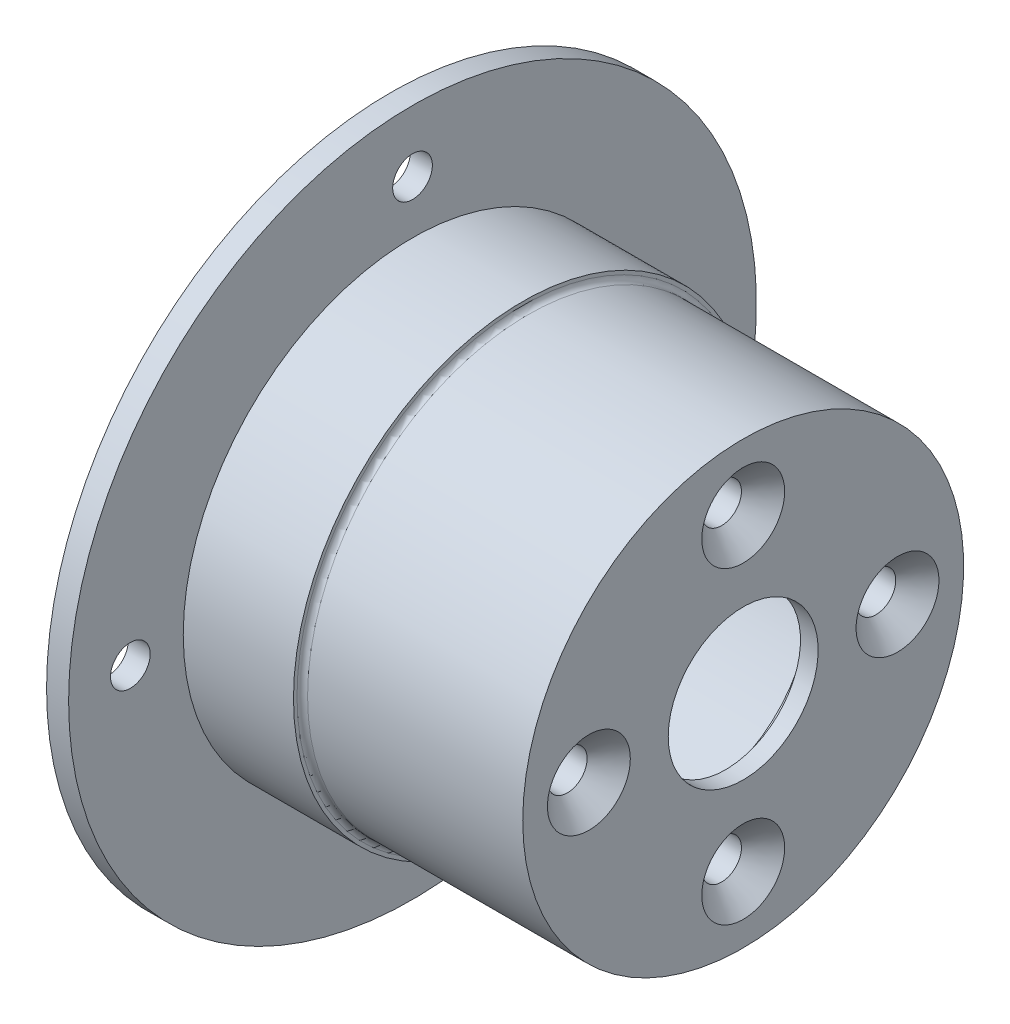
ISO-10303-21;
HEADER;
FILE_DESCRIPTION(('STEP AP214'),'2;1');
FILE_NAME('part.step','',(''),(''),'','','');
FILE_SCHEMA(('AUTOMOTIVE_DESIGN { 1 0 10303 214 1 1 1 1 }'));
ENDSEC;
DATA;
#1=APPLICATION_CONTEXT('core data for automotive mechanical design processes');
#2=APPLICATION_PROTOCOL_DEFINITION('international standard','automotive_design',2000,#1);
#3=PRODUCT_CONTEXT('',#1,'mechanical');
#4=PRODUCT('Part','Part','',(#3));
#5=PRODUCT_RELATED_PRODUCT_CATEGORY('part','',(#4));
#6=PRODUCT_DEFINITION_FORMATION('','',#4);
#7=PRODUCT_DEFINITION_CONTEXT('part definition',#1,'design');
#8=PRODUCT_DEFINITION('design','',#6,#7);
#9=PRODUCT_DEFINITION_SHAPE('','',#8);
#10=(LENGTH_UNIT() NAMED_UNIT(*) SI_UNIT(.MILLI.,.METRE.));
#11=(NAMED_UNIT(*) PLANE_ANGLE_UNIT() SI_UNIT($,.RADIAN.));
#12=(NAMED_UNIT(*) SI_UNIT($,.STERADIAN.) SOLID_ANGLE_UNIT());
#13=UNCERTAINTY_MEASURE_WITH_UNIT(LENGTH_MEASURE(1.E-05),#10,'distance_accuracy_value','');
#14=(GEOMETRIC_REPRESENTATION_CONTEXT(3) GLOBAL_UNCERTAINTY_ASSIGNED_CONTEXT((#13)) GLOBAL_UNIT_ASSIGNED_CONTEXT((#10,
#11,#12)) REPRESENTATION_CONTEXT('',''));
#15=CARTESIAN_POINT('',(0.,0.,0.));
#16=DIRECTION('',(0.,0.,1.));
#17=DIRECTION('',(1.,0.,0.));
#18=AXIS2_PLACEMENT_3D('',#15,#16,#17);
#19=CARTESIAN_POINT('',(0.,39.,0.));
#20=DIRECTION('',(1.,0.,0.));
#21=DIRECTION('',(0.,0.,-1.));
#22=AXIS2_PLACEMENT_3D('',#19,#20,#21);
#23=PLANE('',#22);
#24=CARTESIAN_POINT('',(0.,-32.,0.));
#25=DIRECTION('',(-1.,0.,0.));
#26=DIRECTION('',(0.,0.,1.));
#27=AXIS2_PLACEMENT_3D('',#24,#25,#26);
#28=CIRCLE('',#27,2.25);
#29=CARTESIAN_POINT('',(0.,-32.,2.25));
#30=VERTEX_POINT('',#29);
#31=EDGE_CURVE('E153',#30,#30,#28,.T.);
#32=ORIENTED_EDGE('',*,*,#31,.F.);
#33=EDGE_LOOP('',(#32));
#34=FACE_BOUND('',#33,.T.);
#35=CARTESIAN_POINT('',(0.,0.,-32.));
#36=DIRECTION('',(-1.,0.,0.));
#37=DIRECTION('',(0.,0.,1.));
#38=AXIS2_PLACEMENT_3D('',#35,#36,#37);
#39=CIRCLE('',#38,2.25);
#40=CARTESIAN_POINT('',(0.,0.,-29.75));
#41=VERTEX_POINT('',#40);
#42=EDGE_CURVE('E141',#41,#41,#39,.T.);
#43=ORIENTED_EDGE('',*,*,#42,.F.);
#44=EDGE_LOOP('',(#43));
#45=FACE_BOUND('',#44,.T.);
#46=CARTESIAN_POINT('',(0.,0.,0.));
#47=DIRECTION('',(-1.,0.,0.));
#48=DIRECTION('',(0.,0.,1.));
#49=AXIS2_PLACEMENT_3D('',#46,#47,#48);
#50=CIRCLE('',#49,21.);
#51=CARTESIAN_POINT('',(0.,0.,21.));
#52=VERTEX_POINT('',#51);
#53=EDGE_CURVE('E50',#52,#52,#50,.T.);
#54=ORIENTED_EDGE('',*,*,#53,.F.);
#55=EDGE_LOOP('',(#54));
#56=FACE_BOUND('',#55,.T.);
#57=CARTESIAN_POINT('',(0.,0.,0.));
#58=DIRECTION('',(-1.,0.,0.));
#59=DIRECTION('',(0.,0.,1.));
#60=AXIS2_PLACEMENT_3D('',#57,#58,#59);
#61=CIRCLE('',#60,39.);
#62=CARTESIAN_POINT('',(0.,0.,39.));
#63=VERTEX_POINT('',#62);
#64=EDGE_CURVE('E93',#63,#63,#61,.T.);
#65=ORIENTED_EDGE('',*,*,#64,.T.);
#66=EDGE_LOOP('',(#65));
#67=FACE_BOUND('',#66,.T.);
#68=CARTESIAN_POINT('',(0.,0.,32.));
#69=DIRECTION('',(-1.,0.,0.));
#70=DIRECTION('',(0.,0.,1.));
#71=AXIS2_PLACEMENT_3D('',#68,#69,#70);
#72=CIRCLE('',#71,2.25);
#73=CARTESIAN_POINT('',(0.,0.,34.25));
#74=VERTEX_POINT('',#73);
#75=EDGE_CURVE('E147',#74,#74,#72,.T.);
#76=ORIENTED_EDGE('',*,*,#75,.F.);
#77=EDGE_LOOP('',(#76));
#78=FACE_BOUND('',#77,.T.);
#79=CARTESIAN_POINT('',(0.,32.,0.));
#80=DIRECTION('',(-1.,0.,0.));
#81=DIRECTION('',(0.,0.,1.));
#82=AXIS2_PLACEMENT_3D('',#79,#80,#81);
#83=CIRCLE('',#82,2.25);
#84=CARTESIAN_POINT('',(0.,32.,2.25));
#85=VERTEX_POINT('',#84);
#86=EDGE_CURVE('E160',#85,#85,#83,.T.);
#87=ORIENTED_EDGE('',*,*,#86,.F.);
#88=EDGE_LOOP('',(#87));
#89=FACE_BOUND('',#88,.T.);
#90=ADVANCED_FACE('F36',(#34,#45,#56,#67,#78,#89),#23,.F.);
#91=CARTESIAN_POINT('',(-64.1033524540557,0.,0.));
#92=DIRECTION('',(-1.,0.,0.));
#93=DIRECTION('',(0.,0.,1.));
#94=AXIS2_PLACEMENT_3D('',#91,#92,#93);
#95=CYLINDRICAL_SURFACE('',#94,21.);
#96=CARTESIAN_POINT('',(35.,0.,0.));
#97=DIRECTION('',(-1.,0.,0.));
#98=DIRECTION('',(0.,0.,1.));
#99=AXIS2_PLACEMENT_3D('',#96,#97,#98);
#100=CIRCLE('',#99,21.);
#101=CARTESIAN_POINT('',(35.,0.,21.));
#102=VERTEX_POINT('',#101);
#103=EDGE_CURVE('E56',#102,#102,#100,.T.);
#104=ORIENTED_EDGE('',*,*,#103,.F.);
#105=EDGE_LOOP('',(#104));
#106=FACE_BOUND('',#105,.T.);
#107=ORIENTED_EDGE('',*,*,#53,.T.);
#108=EDGE_LOOP('',(#107));
#109=FACE_BOUND('',#108,.T.);
#110=ADVANCED_FACE('F167',(#106,#109),#95,.F.);
#111=CARTESIAN_POINT('',(35.,21.,0.));
#112=DIRECTION('',(1.,0.,0.));
#113=DIRECTION('',(0.,0.,-1.));
#114=AXIS2_PLACEMENT_3D('',#111,#112,#113);
#115=PLANE('',#114);
#116=CARTESIAN_POINT('',(35.,17.5,0.));
#117=DIRECTION('',(1.,0.,0.));
#118=DIRECTION('',(0.,0.,-1.));
#119=AXIS2_PLACEMENT_3D('',#116,#117,#118);
#120=CIRCLE('',#119,2.24999999999999);
#121=CARTESIAN_POINT('',(35.,17.5,-2.24999999999999));
#122=VERTEX_POINT('',#121);
#123=EDGE_CURVE('E129',#122,#122,#120,.T.);
#124=ORIENTED_EDGE('',*,*,#123,.T.);
#125=EDGE_LOOP('',(#124));
#126=FACE_BOUND('',#125,.T.);
#127=CARTESIAN_POINT('',(35.,0.,-17.5));
#128=DIRECTION('',(1.,0.,0.));
#129=DIRECTION('',(0.,0.,-1.));
#130=AXIS2_PLACEMENT_3D('',#127,#128,#129);
#131=CIRCLE('',#130,2.24999999999999);
#132=CARTESIAN_POINT('',(35.,0.,-19.75));
#133=VERTEX_POINT('',#132);
#134=EDGE_CURVE('E118',#133,#133,#131,.T.);
#135=ORIENTED_EDGE('',*,*,#134,.T.);
#136=EDGE_LOOP('',(#135));
#137=FACE_BOUND('',#136,.T.);
#138=CARTESIAN_POINT('',(35.,-17.5,0.));
#139=DIRECTION('',(1.,0.,0.));
#140=DIRECTION('',(0.,0.,-1.));
#141=AXIS2_PLACEMENT_3D('',#138,#139,#140);
#142=CIRCLE('',#141,2.24999999999999);
#143=CARTESIAN_POINT('',(35.,-17.5,-2.24999999999999));
#144=VERTEX_POINT('',#143);
#145=EDGE_CURVE('E106',#144,#144,#142,.T.);
#146=ORIENTED_EDGE('',*,*,#145,.T.);
#147=EDGE_LOOP('',(#146));
#148=FACE_BOUND('',#147,.T.);
#149=CARTESIAN_POINT('',(35.,0.,17.5));
#150=DIRECTION('',(1.,0.,0.));
#151=DIRECTION('',(0.,0.,-1.));
#152=AXIS2_PLACEMENT_3D('',#149,#150,#151);
#153=CIRCLE('',#152,2.24999999999999);
#154=CARTESIAN_POINT('',(35.,0.,15.25));
#155=VERTEX_POINT('',#154);
#156=EDGE_CURVE('E97',#155,#155,#153,.T.);
#157=ORIENTED_EDGE('',*,*,#156,.T.);
#158=EDGE_LOOP('',(#157));
#159=FACE_BOUND('',#158,.T.);
#160=CARTESIAN_POINT('',(35.,0.,0.));
#161=DIRECTION('',(-1.,0.,0.));
#162=DIRECTION('',(0.,0.,1.));
#163=AXIS2_PLACEMENT_3D('',#160,#161,#162);
#164=CIRCLE('',#163,12.5);
#165=CARTESIAN_POINT('',(35.,0.,12.5));
#166=VERTEX_POINT('',#165);
#167=EDGE_CURVE('E62',#166,#166,#164,.T.);
#168=ORIENTED_EDGE('',*,*,#167,.F.);
#169=EDGE_LOOP('',(#168));
#170=FACE_BOUND('',#169,.T.);
#171=ORIENTED_EDGE('',*,*,#103,.T.);
#172=EDGE_LOOP('',(#171));
#173=FACE_BOUND('',#172,.T.);
#174=ADVANCED_FACE('F173',(#126,#137,#148,#159,#170,#173),#115,.F.);
#175=CARTESIAN_POINT('',(-64.1033524540557,0.,0.));
#176=DIRECTION('',(-1.,0.,0.));
#177=DIRECTION('',(0.,0.,1.));
#178=AXIS2_PLACEMENT_3D('',#175,#176,#177);
#179=CYLINDRICAL_SURFACE('',#178,12.5);
#180=CARTESIAN_POINT('',(38.,0.,0.));
#181=DIRECTION('',(-1.,0.,0.));
#182=DIRECTION('',(0.,0.,1.));
#183=AXIS2_PLACEMENT_3D('',#180,#181,#182);
#184=CIRCLE('',#183,12.5);
#185=CARTESIAN_POINT('',(38.,0.,12.5));
#186=VERTEX_POINT('',#185);
#187=EDGE_CURVE('E66',#186,#186,#184,.T.);
#188=ORIENTED_EDGE('',*,*,#187,.F.);
#189=EDGE_LOOP('',(#188));
#190=FACE_BOUND('',#189,.T.);
#191=ORIENTED_EDGE('',*,*,#167,.T.);
#192=EDGE_LOOP('',(#191));
#193=FACE_BOUND('',#192,.T.);
#194=ADVANCED_FACE('F210',(#190,#193),#179,.F.);
#195=CARTESIAN_POINT('',(38.,12.5,0.));
#196=DIRECTION('',(1.,0.,0.));
#197=DIRECTION('',(0.,0.,-1.));
#198=AXIS2_PLACEMENT_3D('',#195,#196,#197);
#199=PLANE('',#198);
#200=CARTESIAN_POINT('',(38.,0.,0.));
#201=DIRECTION('',(-1.,0.,0.));
#202=DIRECTION('',(0.,0.,1.));
#203=AXIS2_PLACEMENT_3D('',#200,#201,#202);
#204=CIRCLE('',#203,8.5);
#205=CARTESIAN_POINT('',(38.,0.,8.5));
#206=VERTEX_POINT('',#205);
#207=EDGE_CURVE('E70',#206,#206,#204,.T.);
#208=ORIENTED_EDGE('',*,*,#207,.F.);
#209=EDGE_LOOP('',(#208));
#210=FACE_BOUND('',#209,.T.);
#211=ORIENTED_EDGE('',*,*,#187,.T.);
#212=EDGE_LOOP('',(#211));
#213=FACE_BOUND('',#212,.T.);
#214=ADVANCED_FACE('F206',(#210,#213),#199,.F.);
#215=CARTESIAN_POINT('',(-64.1033524540557,0.,0.));
#216=DIRECTION('',(-1.,0.,0.));
#217=DIRECTION('',(0.,0.,1.));
#218=AXIS2_PLACEMENT_3D('',#215,#216,#217);
#219=CYLINDRICAL_SURFACE('',#218,8.5);
#220=CARTESIAN_POINT('',(40.,0.,0.));
#221=DIRECTION('',(-1.,0.,0.));
#222=DIRECTION('',(0.,0.,1.));
#223=AXIS2_PLACEMENT_3D('',#220,#221,#222);
#224=CIRCLE('',#223,8.5);
#225=CARTESIAN_POINT('',(40.,0.,8.5));
#226=VERTEX_POINT('',#225);
#227=EDGE_CURVE('E74',#226,#226,#224,.T.);
#228=ORIENTED_EDGE('',*,*,#227,.F.);
#229=EDGE_LOOP('',(#228));
#230=FACE_BOUND('',#229,.T.);
#231=ORIENTED_EDGE('',*,*,#207,.T.);
#232=EDGE_LOOP('',(#231));
#233=FACE_BOUND('',#232,.T.);
#234=ADVANCED_FACE('F202',(#230,#233),#219,.F.);
#235=CARTESIAN_POINT('',(40.,8.5,0.));
#236=DIRECTION('',(-1.,0.,0.));
#237=DIRECTION('',(0.,0.,1.));
#238=AXIS2_PLACEMENT_3D('',#235,#236,#237);
#239=PLANE('',#238);
#240=CARTESIAN_POINT('',(40.,17.5,0.));
#241=DIRECTION('',(1.,0.,0.));
#242=DIRECTION('',(0.,0.,-1.));
#243=AXIS2_PLACEMENT_3D('',#240,#241,#242);
#244=CIRCLE('',#243,4.7);
#245=CARTESIAN_POINT('',(40.,17.5,-4.7));
#246=VERTEX_POINT('',#245);
#247=EDGE_CURVE('E135',#246,#246,#244,.T.);
#248=ORIENTED_EDGE('',*,*,#247,.F.);
#249=EDGE_LOOP('',(#248));
#250=FACE_BOUND('',#249,.T.);
#251=CARTESIAN_POINT('',(40.,0.,-17.5));
#252=DIRECTION('',(1.,0.,0.));
#253=DIRECTION('',(0.,0.,-1.));
#254=AXIS2_PLACEMENT_3D('',#251,#252,#253);
#255=CIRCLE('',#254,4.7);
#256=CARTESIAN_POINT('',(40.,0.,-22.2));
#257=VERTEX_POINT('',#256);
#258=EDGE_CURVE('E125',#257,#257,#255,.T.);
#259=ORIENTED_EDGE('',*,*,#258,.F.);
#260=EDGE_LOOP('',(#259));
#261=FACE_BOUND('',#260,.T.);
#262=CARTESIAN_POINT('',(40.,-17.5,0.));
#263=DIRECTION('',(1.,0.,0.));
#264=DIRECTION('',(0.,0.,-1.));
#265=AXIS2_PLACEMENT_3D('',#262,#263,#264);
#266=CIRCLE('',#265,4.7);
#267=CARTESIAN_POINT('',(40.,-17.5,-4.7));
#268=VERTEX_POINT('',#267);
#269=EDGE_CURVE('E114',#268,#268,#266,.T.);
#270=ORIENTED_EDGE('',*,*,#269,.F.);
#271=EDGE_LOOP('',(#270));
#272=FACE_BOUND('',#271,.T.);
#273=CARTESIAN_POINT('',(40.,0.,17.5));
#274=DIRECTION('',(1.,0.,0.));
#275=DIRECTION('',(0.,0.,-1.));
#276=AXIS2_PLACEMENT_3D('',#273,#274,#275);
#277=CIRCLE('',#276,4.7);
#278=CARTESIAN_POINT('',(40.,0.,12.8));
#279=VERTEX_POINT('',#278);
#280=EDGE_CURVE('E103',#279,#279,#277,.T.);
#281=ORIENTED_EDGE('',*,*,#280,.F.);
#282=EDGE_LOOP('',(#281));
#283=FACE_BOUND('',#282,.T.);
#284=CARTESIAN_POINT('',(40.,0.,0.));
#285=DIRECTION('',(-1.,0.,0.));
#286=DIRECTION('',(0.,0.,1.));
#287=AXIS2_PLACEMENT_3D('',#284,#285,#286);
#288=CIRCLE('',#287,25.);
#289=CARTESIAN_POINT('',(40.,0.,25.));
#290=VERTEX_POINT('',#289);
#291=EDGE_CURVE('E78',#290,#290,#288,.T.);
#292=ORIENTED_EDGE('',*,*,#291,.F.);
#293=EDGE_LOOP('',(#292));
#294=FACE_BOUND('',#293,.T.);
#295=ORIENTED_EDGE('',*,*,#227,.T.);
#296=EDGE_LOOP('',(#295));
#297=FACE_BOUND('',#296,.T.);
#298=ADVANCED_FACE('F199',(#250,#261,#272,#283,#294,#297),#239,.F.);
#299=CARTESIAN_POINT('',(-64.1033524540557,0.,0.));
#300=DIRECTION('',(-1.,0.,0.));
#301=DIRECTION('',(0.,0.,1.));
#302=AXIS2_PLACEMENT_3D('',#299,#300,#301);
#303=CYLINDRICAL_SURFACE('',#302,25.);
#304=CARTESIAN_POINT('',(15.6,0.,0.));
#305=DIRECTION('',(-1.,0.,0.));
#306=DIRECTION('',(0.,0.,1.));
#307=AXIS2_PLACEMENT_3D('',#304,#305,#306);
#308=CIRCLE('',#307,25.);
#309=CARTESIAN_POINT('',(15.6,0.,25.));
#310=VERTEX_POINT('',#309);
#311=EDGE_CURVE('E10',#310,#310,#308,.F.);
#312=ORIENTED_EDGE('',*,*,#311,.T.);
#313=EDGE_LOOP('',(#312));
#314=FACE_BOUND('',#313,.T.);
#315=ORIENTED_EDGE('',*,*,#291,.T.);
#316=EDGE_LOOP('',(#315));
#317=FACE_BOUND('',#316,.T.);
#318=ADVANCED_FACE('F196',(#314,#317),#303,.T.);
#319=CARTESIAN_POINT('',(15.,25.,0.));
#320=DIRECTION('',(-1.,0.,0.));
#321=DIRECTION('',(0.,0.,1.));
#322=AXIS2_PLACEMENT_3D('',#319,#320,#321);
#323=PLANE('',#322);
#324=CARTESIAN_POINT('',(15.,0.,0.));
#325=DIRECTION('',(-1.,0.,0.));
#326=DIRECTION('',(0.,0.,1.));
#327=AXIS2_PLACEMENT_3D('',#324,#325,#326);
#328=CIRCLE('',#327,25.6);
#329=CARTESIAN_POINT('',(15.,0.,25.6));
#330=VERTEX_POINT('',#329);
#331=EDGE_CURVE('E44',#330,#330,#328,.T.);
#332=ORIENTED_EDGE('',*,*,#331,.T.);
#333=EDGE_LOOP('',(#332));
#334=FACE_BOUND('',#333,.T.);
#335=CARTESIAN_POINT('',(15.,0.,0.));
#336=DIRECTION('',(-1.,0.,0.));
#337=DIRECTION('',(0.,0.,1.));
#338=AXIS2_PLACEMENT_3D('',#335,#336,#337);
#339=CIRCLE('',#338,26.);
#340=CARTESIAN_POINT('',(15.,0.,26.));
#341=VERTEX_POINT('',#340);
#342=EDGE_CURVE('E82',#341,#341,#339,.T.);
#343=ORIENTED_EDGE('',*,*,#342,.F.);
#344=EDGE_LOOP('',(#343));
#345=FACE_BOUND('',#344,.T.);
#346=ADVANCED_FACE('F192',(#334,#345),#323,.F.);
#347=CARTESIAN_POINT('',(-64.1033524540557,0.,0.));
#348=DIRECTION('',(-1.,0.,0.));
#349=DIRECTION('',(0.,0.,1.));
#350=AXIS2_PLACEMENT_3D('',#347,#348,#349);
#351=CYLINDRICAL_SURFACE('',#350,26.);
#352=CARTESIAN_POINT('',(2.5,0.,0.));
#353=DIRECTION('',(-1.,0.,0.));
#354=DIRECTION('',(0.,0.,1.));
#355=AXIS2_PLACEMENT_3D('',#352,#353,#354);
#356=CIRCLE('',#355,26.);
#357=CARTESIAN_POINT('',(2.5,0.,26.));
#358=VERTEX_POINT('',#357);
#359=EDGE_CURVE('E85',#358,#358,#356,.T.);
#360=ORIENTED_EDGE('',*,*,#359,.F.);
#361=EDGE_LOOP('',(#360));
#362=FACE_BOUND('',#361,.T.);
#363=ORIENTED_EDGE('',*,*,#342,.T.);
#364=EDGE_LOOP('',(#363));
#365=FACE_BOUND('',#364,.T.);
#366=ADVANCED_FACE('F188',(#362,#365),#351,.T.);
#367=CARTESIAN_POINT('',(2.5,26.,0.));
#368=DIRECTION('',(-1.,0.,0.));
#369=DIRECTION('',(0.,0.,1.));
#370=AXIS2_PLACEMENT_3D('',#367,#368,#369);
#371=PLANE('',#370);
#372=CARTESIAN_POINT('',(2.5,32.,0.));
#373=DIRECTION('',(-1.,0.,0.));
#374=DIRECTION('',(0.,0.,1.));
#375=AXIS2_PLACEMENT_3D('',#372,#373,#374);
#376=CIRCLE('',#375,2.25);
#377=CARTESIAN_POINT('',(2.5,32.,2.25));
#378=VERTEX_POINT('',#377);
#379=EDGE_CURVE('E156',#378,#378,#376,.T.);
#380=ORIENTED_EDGE('',*,*,#379,.T.);
#381=EDGE_LOOP('',(#380));
#382=FACE_BOUND('',#381,.T.);
#383=CARTESIAN_POINT('',(2.5,-32.,0.));
#384=DIRECTION('',(-1.,0.,0.));
#385=DIRECTION('',(0.,0.,1.));
#386=AXIS2_PLACEMENT_3D('',#383,#384,#385);
#387=CIRCLE('',#386,2.25);
#388=CARTESIAN_POINT('',(2.5,-32.,2.25));
#389=VERTEX_POINT('',#388);
#390=EDGE_CURVE('E150',#389,#389,#387,.T.);
#391=ORIENTED_EDGE('',*,*,#390,.T.);
#392=EDGE_LOOP('',(#391));
#393=FACE_BOUND('',#392,.T.);
#394=CARTESIAN_POINT('',(2.5,0.,32.));
#395=DIRECTION('',(-1.,0.,0.));
#396=DIRECTION('',(0.,0.,1.));
#397=AXIS2_PLACEMENT_3D('',#394,#395,#396);
#398=CIRCLE('',#397,2.25);
#399=CARTESIAN_POINT('',(2.5,0.,34.25));
#400=VERTEX_POINT('',#399);
#401=EDGE_CURVE('E144',#400,#400,#398,.T.);
#402=ORIENTED_EDGE('',*,*,#401,.T.);
#403=EDGE_LOOP('',(#402));
#404=FACE_BOUND('',#403,.T.);
#405=CARTESIAN_POINT('',(2.5,0.,-32.));
#406=DIRECTION('',(-1.,0.,0.));
#407=DIRECTION('',(0.,0.,1.));
#408=AXIS2_PLACEMENT_3D('',#405,#406,#407);
#409=CIRCLE('',#408,2.25);
#410=CARTESIAN_POINT('',(2.5,0.,-29.75));
#411=VERTEX_POINT('',#410);
#412=EDGE_CURVE('E138',#411,#411,#409,.T.);
#413=ORIENTED_EDGE('',*,*,#412,.T.);
#414=EDGE_LOOP('',(#413));
#415=FACE_BOUND('',#414,.T.);
#416=CARTESIAN_POINT('',(2.5,0.,0.));
#417=DIRECTION('',(-1.,0.,0.));
#418=DIRECTION('',(0.,0.,1.));
#419=AXIS2_PLACEMENT_3D('',#416,#417,#418);
#420=CIRCLE('',#419,39.);
#421=CARTESIAN_POINT('',(2.5,0.,39.));
#422=VERTEX_POINT('',#421);
#423=EDGE_CURVE('E89',#422,#422,#420,.T.);
#424=ORIENTED_EDGE('',*,*,#423,.F.);
#425=EDGE_LOOP('',(#424));
#426=FACE_BOUND('',#425,.T.);
#427=ORIENTED_EDGE('',*,*,#359,.T.);
#428=EDGE_LOOP('',(#427));
#429=FACE_BOUND('',#428,.T.);
#430=ADVANCED_FACE('F184',(#382,#393,#404,#415,#426,#429),#371,.F.);
#431=CARTESIAN_POINT('',(-64.1033524540557,0.,0.));
#432=DIRECTION('',(-1.,0.,0.));
#433=DIRECTION('',(0.,0.,1.));
#434=AXIS2_PLACEMENT_3D('',#431,#432,#433);
#435=CYLINDRICAL_SURFACE('',#434,39.);
#436=ORIENTED_EDGE('',*,*,#64,.F.);
#437=EDGE_LOOP('',(#436));
#438=FACE_BOUND('',#437,.T.);
#439=ORIENTED_EDGE('',*,*,#423,.T.);
#440=EDGE_LOOP('',(#439));
#441=FACE_BOUND('',#440,.T.);
#442=ADVANCED_FACE('F181',(#438,#441),#435,.T.);
#443=CARTESIAN_POINT('',(40.,0.,17.5));
#444=DIRECTION('',(1.,0.,0.));
#445=DIRECTION('',(0.,0.,-1.));
#446=AXIS2_PLACEMENT_3D('',#443,#444,#445);
#447=CYLINDRICAL_SURFACE('',#446,2.24999999999999);
#448=ORIENTED_EDGE('',*,*,#156,.F.);
#449=EDGE_LOOP('',(#448));
#450=FACE_BOUND('',#449,.T.);
#451=CARTESIAN_POINT('',(37.55,0.,17.5));
#452=DIRECTION('',(1.,0.,0.));
#453=DIRECTION('',(0.,0.,-1.));
#454=AXIS2_PLACEMENT_3D('',#451,#452,#453);
#455=CIRCLE('',#454,2.24999999999999);
#456=CARTESIAN_POINT('',(37.55,0.,15.25));
#457=VERTEX_POINT('',#456);
#458=EDGE_CURVE('E100',#457,#457,#455,.T.);
#459=ORIENTED_EDGE('',*,*,#458,.T.);
#460=EDGE_LOOP('',(#459));
#461=FACE_BOUND('',#460,.T.);
#462=ADVANCED_FACE('F179',(#450,#461),#447,.F.);
#463=CARTESIAN_POINT('',(40.,0.,17.5));
#464=DIRECTION('',(1.,0.,0.));
#465=DIRECTION('',(0.,0.,-1.));
#466=AXIS2_PLACEMENT_3D('',#463,#464,#465);
#467=CONICAL_SURFACE('',#466,4.7,0.785398163397449);
#468=ORIENTED_EDGE('',*,*,#458,.F.);
#469=EDGE_LOOP('',(#468));
#470=FACE_BOUND('',#469,.T.);
#471=ORIENTED_EDGE('',*,*,#280,.T.);
#472=EDGE_LOOP('',(#471));
#473=FACE_BOUND('',#472,.T.);
#474=ADVANCED_FACE('F277',(#470,#473),#467,.F.);
#475=CARTESIAN_POINT('',(40.,-17.5,0.));
#476=DIRECTION('',(1.,0.,0.));
#477=DIRECTION('',(0.,0.,-1.));
#478=AXIS2_PLACEMENT_3D('',#475,#476,#477);
#479=CYLINDRICAL_SURFACE('',#478,2.24999999999999);
#480=ORIENTED_EDGE('',*,*,#145,.F.);
#481=EDGE_LOOP('',(#480));
#482=FACE_BOUND('',#481,.T.);
#483=CARTESIAN_POINT('',(37.55,-17.5,0.));
#484=DIRECTION('',(1.,0.,0.));
#485=DIRECTION('',(0.,0.,-1.));
#486=AXIS2_PLACEMENT_3D('',#483,#484,#485);
#487=CIRCLE('',#486,2.24999999999999);
#488=CARTESIAN_POINT('',(37.55,-17.5,-2.24999999999999));
#489=VERTEX_POINT('',#488);
#490=EDGE_CURVE('E110',#489,#489,#487,.T.);
#491=ORIENTED_EDGE('',*,*,#490,.T.);
#492=EDGE_LOOP('',(#491));
#493=FACE_BOUND('',#492,.T.);
#494=ADVANCED_FACE('F274',(#482,#493),#479,.F.);
#495=CARTESIAN_POINT('',(40.,-17.5,0.));
#496=DIRECTION('',(1.,0.,0.));
#497=DIRECTION('',(0.,0.,-1.));
#498=AXIS2_PLACEMENT_3D('',#495,#496,#497);
#499=CONICAL_SURFACE('',#498,4.7,0.785398163397449);
#500=ORIENTED_EDGE('',*,*,#490,.F.);
#501=EDGE_LOOP('',(#500));
#502=FACE_BOUND('',#501,.T.);
#503=ORIENTED_EDGE('',*,*,#269,.T.);
#504=EDGE_LOOP('',(#503));
#505=FACE_BOUND('',#504,.T.);
#506=ADVANCED_FACE('F270',(#502,#505),#499,.F.);
#507=CARTESIAN_POINT('',(40.,0.,-17.5));
#508=DIRECTION('',(1.,0.,0.));
#509=DIRECTION('',(0.,0.,-1.));
#510=AXIS2_PLACEMENT_3D('',#507,#508,#509);
#511=CYLINDRICAL_SURFACE('',#510,2.24999999999999);
#512=ORIENTED_EDGE('',*,*,#134,.F.);
#513=EDGE_LOOP('',(#512));
#514=FACE_BOUND('',#513,.T.);
#515=CARTESIAN_POINT('',(37.55,0.,-17.5));
#516=DIRECTION('',(1.,0.,0.));
#517=DIRECTION('',(0.,0.,-1.));
#518=AXIS2_PLACEMENT_3D('',#515,#516,#517);
#519=CIRCLE('',#518,2.24999999999999);
#520=CARTESIAN_POINT('',(37.55,0.,-19.75));
#521=VERTEX_POINT('',#520);
#522=EDGE_CURVE('E121',#521,#521,#519,.T.);
#523=ORIENTED_EDGE('',*,*,#522,.T.);
#524=EDGE_LOOP('',(#523));
#525=FACE_BOUND('',#524,.T.);
#526=ADVANCED_FACE('F266',(#514,#525),#511,.F.);
#527=CARTESIAN_POINT('',(40.,0.,-17.5));
#528=DIRECTION('',(1.,0.,0.));
#529=DIRECTION('',(0.,0.,-1.));
#530=AXIS2_PLACEMENT_3D('',#527,#528,#529);
#531=CONICAL_SURFACE('',#530,4.7,0.785398163397449);
#532=ORIENTED_EDGE('',*,*,#522,.F.);
#533=EDGE_LOOP('',(#532));
#534=FACE_BOUND('',#533,.T.);
#535=ORIENTED_EDGE('',*,*,#258,.T.);
#536=EDGE_LOOP('',(#535));
#537=FACE_BOUND('',#536,.T.);
#538=ADVANCED_FACE('F262',(#534,#537),#531,.F.);
#539=CARTESIAN_POINT('',(40.,17.5,0.));
#540=DIRECTION('',(1.,0.,0.));
#541=DIRECTION('',(0.,0.,-1.));
#542=AXIS2_PLACEMENT_3D('',#539,#540,#541);
#543=CYLINDRICAL_SURFACE('',#542,2.24999999999999);
#544=ORIENTED_EDGE('',*,*,#123,.F.);
#545=EDGE_LOOP('',(#544));
#546=FACE_BOUND('',#545,.T.);
#547=CARTESIAN_POINT('',(37.55,17.5,0.));
#548=DIRECTION('',(1.,0.,0.));
#549=DIRECTION('',(0.,0.,-1.));
#550=AXIS2_PLACEMENT_3D('',#547,#548,#549);
#551=CIRCLE('',#550,2.24999999999999);
#552=CARTESIAN_POINT('',(37.55,17.5,-2.24999999999999));
#553=VERTEX_POINT('',#552);
#554=EDGE_CURVE('E132',#553,#553,#551,.T.);
#555=ORIENTED_EDGE('',*,*,#554,.T.);
#556=EDGE_LOOP('',(#555));
#557=FACE_BOUND('',#556,.T.);
#558=ADVANCED_FACE('F258',(#546,#557),#543,.F.);
#559=CARTESIAN_POINT('',(40.,17.5,0.));
#560=DIRECTION('',(1.,0.,0.));
#561=DIRECTION('',(0.,0.,-1.));
#562=AXIS2_PLACEMENT_3D('',#559,#560,#561);
#563=CONICAL_SURFACE('',#562,4.7,0.785398163397449);
#564=ORIENTED_EDGE('',*,*,#554,.F.);
#565=EDGE_LOOP('',(#564));
#566=FACE_BOUND('',#565,.T.);
#567=ORIENTED_EDGE('',*,*,#247,.T.);
#568=EDGE_LOOP('',(#567));
#569=FACE_BOUND('',#568,.T.);
#570=ADVANCED_FACE('F255',(#566,#569),#563,.F.);
#571=CARTESIAN_POINT('',(15.6,0.,0.));
#572=DIRECTION('',(-1.,0.,0.));
#573=DIRECTION('',(0.,0.,1.));
#574=AXIS2_PLACEMENT_3D('',#571,#572,#573);
#575=TOROIDAL_SURFACE('',#574,25.6,0.6);
#576=ORIENTED_EDGE('',*,*,#311,.F.);
#577=EDGE_LOOP('',(#576));
#578=FACE_BOUND('',#577,.T.);
#579=ORIENTED_EDGE('',*,*,#331,.F.);
#580=EDGE_LOOP('',(#579));
#581=FACE_BOUND('',#580,.T.);
#582=ADVANCED_FACE('F38',(#578,#581),#575,.F.);
#583=CARTESIAN_POINT('',(0.,0.,-32.));
#584=DIRECTION('',(-1.,0.,0.));
#585=DIRECTION('',(0.,0.,1.));
#586=AXIS2_PLACEMENT_3D('',#583,#584,#585);
#587=CYLINDRICAL_SURFACE('',#586,2.25);
#588=ORIENTED_EDGE('',*,*,#412,.F.);
#589=EDGE_LOOP('',(#588));
#590=FACE_BOUND('',#589,.T.);
#591=ORIENTED_EDGE('',*,*,#42,.T.);
#592=EDGE_LOOP('',(#591));
#593=FACE_BOUND('',#592,.T.);
#594=ADVANCED_FACE('F241',(#590,#593),#587,.F.);
#595=CARTESIAN_POINT('',(0.,0.,32.));
#596=DIRECTION('',(-1.,0.,0.));
#597=DIRECTION('',(0.,0.,1.));
#598=AXIS2_PLACEMENT_3D('',#595,#596,#597);
#599=CYLINDRICAL_SURFACE('',#598,2.25);
#600=ORIENTED_EDGE('',*,*,#401,.F.);
#601=EDGE_LOOP('',(#600));
#602=FACE_BOUND('',#601,.T.);
#603=ORIENTED_EDGE('',*,*,#75,.T.);
#604=EDGE_LOOP('',(#603));
#605=FACE_BOUND('',#604,.T.);
#606=ADVANCED_FACE('F238',(#602,#605),#599,.F.);
#607=CARTESIAN_POINT('',(0.,-32.,0.));
#608=DIRECTION('',(-1.,0.,0.));
#609=DIRECTION('',(0.,0.,1.));
#610=AXIS2_PLACEMENT_3D('',#607,#608,#609);
#611=CYLINDRICAL_SURFACE('',#610,2.25);
#612=ORIENTED_EDGE('',*,*,#390,.F.);
#613=EDGE_LOOP('',(#612));
#614=FACE_BOUND('',#613,.T.);
#615=ORIENTED_EDGE('',*,*,#31,.T.);
#616=EDGE_LOOP('',(#615));
#617=FACE_BOUND('',#616,.T.);
#618=ADVANCED_FACE('F240',(#614,#617),#611,.F.);
#619=CARTESIAN_POINT('',(0.,32.,0.));
#620=DIRECTION('',(-1.,0.,0.));
#621=DIRECTION('',(0.,0.,1.));
#622=AXIS2_PLACEMENT_3D('',#619,#620,#621);
#623=CYLINDRICAL_SURFACE('',#622,2.25);
#624=ORIENTED_EDGE('',*,*,#379,.F.);
#625=EDGE_LOOP('',(#624));
#626=FACE_BOUND('',#625,.T.);
#627=ORIENTED_EDGE('',*,*,#86,.T.);
#628=EDGE_LOOP('',(#627));
#629=FACE_BOUND('',#628,.T.);
#630=ADVANCED_FACE('F164',(#626,#629),#623,.F.);
#631=CLOSED_SHELL('',(#90,#110,#174,#194,#214,#234,#298,#318,#346,#366,#430,#442,#462,#474,#494,
#506,#526,#538,#558,#570,#582,#594,#606,#618,#630));
#632=MANIFOLD_SOLID_BREP('B2',#631);
#633=ADVANCED_BREP_SHAPE_REPRESENTATION('',(#18,#632),#14);
#634=SHAPE_DEFINITION_REPRESENTATION(#9,#633);
ENDSEC;
END-ISO-10303-21;
